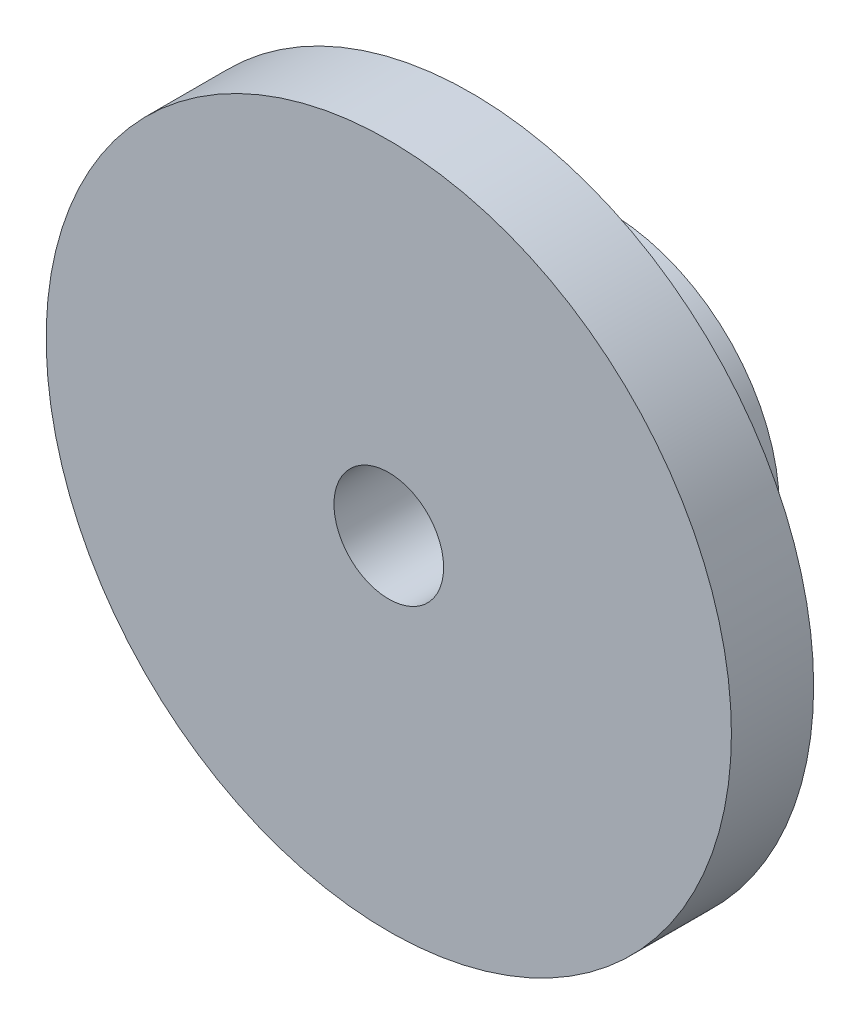
ISO-10303-21;
HEADER;
FILE_DESCRIPTION(('STEP AP214'),'2;1');
FILE_NAME('part.step','',(''),(''),'','','');
FILE_SCHEMA(('AUTOMOTIVE_DESIGN { 1 0 10303 214 1 1 1 1 }'));
ENDSEC;
DATA;
#1=APPLICATION_CONTEXT('core data for automotive mechanical design processes');
#2=APPLICATION_PROTOCOL_DEFINITION('international standard','automotive_design',2000,#1);
#3=PRODUCT_CONTEXT('',#1,'mechanical');
#4=PRODUCT('Part','Part','',(#3));
#5=PRODUCT_RELATED_PRODUCT_CATEGORY('part','',(#4));
#6=PRODUCT_DEFINITION_FORMATION('','',#4);
#7=PRODUCT_DEFINITION_CONTEXT('part definition',#1,'design');
#8=PRODUCT_DEFINITION('design','',#6,#7);
#9=PRODUCT_DEFINITION_SHAPE('','',#8);
#10=(LENGTH_UNIT() NAMED_UNIT(*) SI_UNIT(.MILLI.,.METRE.));
#11=(NAMED_UNIT(*) PLANE_ANGLE_UNIT() SI_UNIT($,.RADIAN.));
#12=(NAMED_UNIT(*) SI_UNIT($,.STERADIAN.) SOLID_ANGLE_UNIT());
#13=UNCERTAINTY_MEASURE_WITH_UNIT(LENGTH_MEASURE(1.E-05),#10,'distance_accuracy_value','');
#14=(GEOMETRIC_REPRESENTATION_CONTEXT(3) GLOBAL_UNCERTAINTY_ASSIGNED_CONTEXT((#13)) GLOBAL_UNIT_ASSIGNED_CONTEXT((#10,
#11,#12)) REPRESENTATION_CONTEXT('',''));
#15=CARTESIAN_POINT('',(0.,0.,0.));
#16=DIRECTION('',(0.,0.,1.));
#17=DIRECTION('',(1.,0.,0.));
#18=AXIS2_PLACEMENT_3D('',#15,#16,#17);
#19=CARTESIAN_POINT('',(0.,0.,6.));
#20=DIRECTION('',(0.,0.,-1.));
#21=DIRECTION('',(-1.,0.,0.));
#22=AXIS2_PLACEMENT_3D('',#19,#20,#21);
#23=CYLINDRICAL_SURFACE('',#22,25.);
#24=CARTESIAN_POINT('',(0.,0.,6.));
#25=DIRECTION('',(0.,0.,1.));
#26=DIRECTION('',(1.,0.,0.));
#27=AXIS2_PLACEMENT_3D('',#24,#25,#26);
#28=CIRCLE('',#27,25.);
#29=CARTESIAN_POINT('',(25.,0.,6.));
#30=VERTEX_POINT('',#29);
#31=EDGE_CURVE('E39',#30,#30,#28,.T.);
#32=ORIENTED_EDGE('',*,*,#31,.F.);
#33=EDGE_LOOP('',(#32));
#34=FACE_BOUND('',#33,.T.);
#35=CARTESIAN_POINT('',(0.,0.,0.));
#36=DIRECTION('',(0.,0.,1.));
#37=DIRECTION('',(1.,0.,0.));
#38=AXIS2_PLACEMENT_3D('',#35,#36,#37);
#39=CIRCLE('',#38,25.);
#40=CARTESIAN_POINT('',(25.,0.,0.));
#41=VERTEX_POINT('',#40);
#42=EDGE_CURVE('E35',#41,#41,#39,.T.);
#43=ORIENTED_EDGE('',*,*,#42,.T.);
#44=EDGE_LOOP('',(#43));
#45=FACE_BOUND('',#44,.T.);
#46=ADVANCED_FACE('F32',(#34,#45),#23,.T.);
#47=CARTESIAN_POINT('',(0.,0.,6.));
#48=DIRECTION('',(0.,0.,-1.));
#49=DIRECTION('',(-1.,0.,0.));
#50=AXIS2_PLACEMENT_3D('',#47,#48,#49);
#51=CYLINDRICAL_SURFACE('',#50,4.);
#52=CARTESIAN_POINT('',(0.,0.,6.));
#53=DIRECTION('',(0.,0.,1.));
#54=DIRECTION('',(1.,0.,0.));
#55=AXIS2_PLACEMENT_3D('',#52,#53,#54);
#56=CIRCLE('',#55,4.);
#57=CARTESIAN_POINT('',(4.,0.,6.));
#58=VERTEX_POINT('',#57);
#59=EDGE_CURVE('E10',#58,#58,#56,.T.);
#60=ORIENTED_EDGE('',*,*,#59,.T.);
#61=EDGE_LOOP('',(#60));
#62=FACE_BOUND('',#61,.T.);
#63=CARTESIAN_POINT('',(0.,0.,-10.));
#64=DIRECTION('',(0.,0.,1.));
#65=DIRECTION('',(1.,0.,0.));
#66=AXIS2_PLACEMENT_3D('',#63,#64,#65);
#67=CIRCLE('',#66,4.);
#68=CARTESIAN_POINT('',(4.,0.,-10.));
#69=VERTEX_POINT('',#68);
#70=EDGE_CURVE('E48',#69,#69,#67,.T.);
#71=ORIENTED_EDGE('',*,*,#70,.F.);
#72=EDGE_LOOP('',(#71));
#73=FACE_BOUND('',#72,.T.);
#74=ADVANCED_FACE('F58',(#62,#73),#51,.F.);
#75=CARTESIAN_POINT('',(0.,0.,6.));
#76=DIRECTION('',(0.,0.,1.));
#77=DIRECTION('',(1.,0.,0.));
#78=AXIS2_PLACEMENT_3D('',#75,#76,#77);
#79=PLANE('',#78);
#80=ORIENTED_EDGE('',*,*,#31,.T.);
#81=EDGE_LOOP('',(#80));
#82=FACE_BOUND('',#81,.T.);
#83=ORIENTED_EDGE('',*,*,#59,.F.);
#84=EDGE_LOOP('',(#83));
#85=FACE_BOUND('',#84,.T.);
#86=ADVANCED_FACE('F60',(#82,#85),#79,.T.);
#87=CARTESIAN_POINT('',(0.,0.,0.));
#88=DIRECTION('',(0.,0.,1.));
#89=DIRECTION('',(1.,0.,0.));
#90=AXIS2_PLACEMENT_3D('',#87,#88,#89);
#91=PLANE('',#90);
#92=CARTESIAN_POINT('',(0.,0.,0.));
#93=DIRECTION('',(0.,0.,1.));
#94=DIRECTION('',(1.,0.,0.));
#95=AXIS2_PLACEMENT_3D('',#92,#93,#94);
#96=CIRCLE('',#95,12.5);
#97=CARTESIAN_POINT('',(12.5,0.,0.));
#98=VERTEX_POINT('',#97);
#99=EDGE_CURVE('E45',#98,#98,#96,.T.);
#100=ORIENTED_EDGE('',*,*,#99,.T.);
#101=EDGE_LOOP('',(#100));
#102=FACE_BOUND('',#101,.T.);
#103=ORIENTED_EDGE('',*,*,#42,.F.);
#104=EDGE_LOOP('',(#103));
#105=FACE_BOUND('',#104,.T.);
#106=ADVANCED_FACE('F65',(#102,#105),#91,.F.);
#107=CARTESIAN_POINT('',(0.,0.,-10.));
#108=DIRECTION('',(0.,0.,1.));
#109=DIRECTION('',(1.,0.,0.));
#110=AXIS2_PLACEMENT_3D('',#107,#108,#109);
#111=CYLINDRICAL_SURFACE('',#110,12.5);
#112=CARTESIAN_POINT('',(0.,0.,-10.));
#113=DIRECTION('',(0.,0.,1.));
#114=DIRECTION('',(1.,0.,0.));
#115=AXIS2_PLACEMENT_3D('',#112,#113,#114);
#116=CIRCLE('',#115,12.5);
#117=CARTESIAN_POINT('',(12.5,0.,-10.));
#118=VERTEX_POINT('',#117);
#119=EDGE_CURVE('E49',#118,#118,#116,.T.);
#120=ORIENTED_EDGE('',*,*,#119,.T.);
#121=EDGE_LOOP('',(#120));
#122=FACE_BOUND('',#121,.T.);
#123=ORIENTED_EDGE('',*,*,#99,.F.);
#124=EDGE_LOOP('',(#123));
#125=FACE_BOUND('',#124,.T.);
#126=ADVANCED_FACE('F71',(#122,#125),#111,.T.);
#127=CARTESIAN_POINT('',(0.,0.,-10.));
#128=DIRECTION('',(0.,0.,1.));
#129=DIRECTION('',(1.,0.,0.));
#130=AXIS2_PLACEMENT_3D('',#127,#128,#129);
#131=PLANE('',#130);
#132=ORIENTED_EDGE('',*,*,#70,.T.);
#133=EDGE_LOOP('',(#132));
#134=FACE_BOUND('',#133,.T.);
#135=ORIENTED_EDGE('',*,*,#119,.F.);
#136=EDGE_LOOP('',(#135));
#137=FACE_BOUND('',#136,.T.);
#138=ADVANCED_FACE('F55',(#134,#137),#131,.F.);
#139=CLOSED_SHELL('',(#46,#74,#86,#106,#126,#138));
#140=MANIFOLD_SOLID_BREP('B2',#139);
#141=ADVANCED_BREP_SHAPE_REPRESENTATION('',(#18,#140),#14);
#142=SHAPE_DEFINITION_REPRESENTATION(#9,#141);
ENDSEC;
END-ISO-10303-21;
